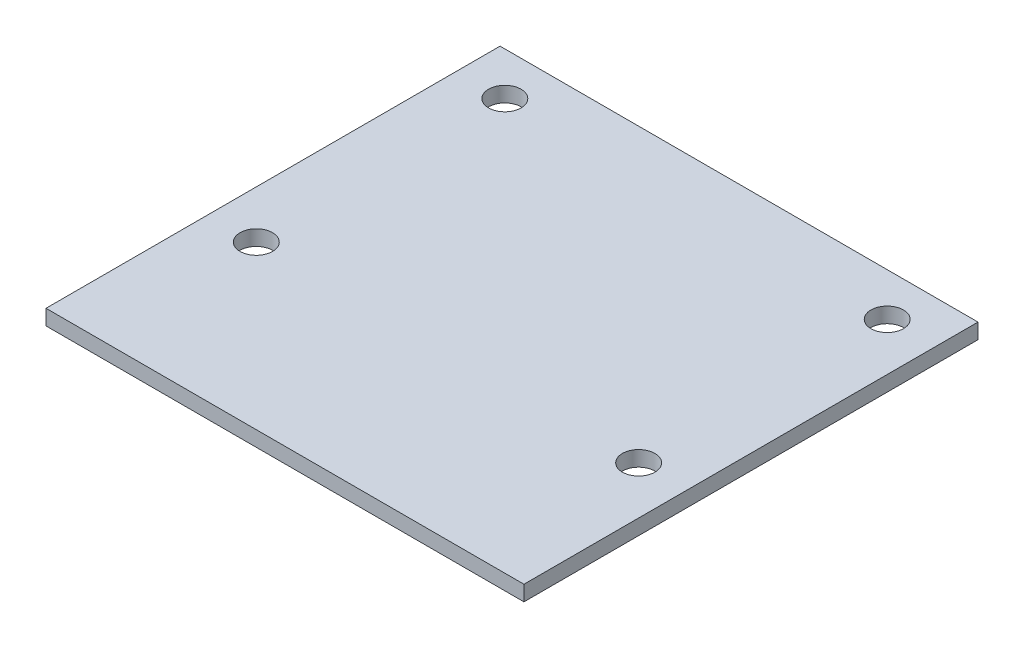
ISO-10303-21;
HEADER;
FILE_DESCRIPTION(('STEP AP214'),'2;1');
FILE_NAME('part.step','',(''),(''),'','','');
FILE_SCHEMA(('AUTOMOTIVE_DESIGN { 1 0 10303 214 1 1 1 1 }'));
ENDSEC;
DATA;
#1=APPLICATION_CONTEXT('core data for automotive mechanical design processes');
#2=APPLICATION_PROTOCOL_DEFINITION('international standard','automotive_design',2000,#1);
#3=PRODUCT_CONTEXT('',#1,'mechanical');
#4=PRODUCT('Part','Part','',(#3));
#5=PRODUCT_RELATED_PRODUCT_CATEGORY('part','',(#4));
#6=PRODUCT_DEFINITION_FORMATION('','',#4);
#7=PRODUCT_DEFINITION_CONTEXT('part definition',#1,'design');
#8=PRODUCT_DEFINITION('design','',#6,#7);
#9=PRODUCT_DEFINITION_SHAPE('','',#8);
#10=(LENGTH_UNIT() NAMED_UNIT(*) SI_UNIT(.MILLI.,.METRE.));
#11=(NAMED_UNIT(*) PLANE_ANGLE_UNIT() SI_UNIT($,.RADIAN.));
#12=(NAMED_UNIT(*) SI_UNIT($,.STERADIAN.) SOLID_ANGLE_UNIT());
#13=UNCERTAINTY_MEASURE_WITH_UNIT(LENGTH_MEASURE(1.E-05),#10,'distance_accuracy_value','');
#14=(GEOMETRIC_REPRESENTATION_CONTEXT(3) GLOBAL_UNCERTAINTY_ASSIGNED_CONTEXT((#13)) GLOBAL_UNIT_ASSIGNED_CONTEXT((#10,
#11,#12)) REPRESENTATION_CONTEXT('',''));
#15=CARTESIAN_POINT('',(0.,0.,0.));
#16=DIRECTION('',(0.,0.,1.));
#17=DIRECTION('',(1.,0.,0.));
#18=AXIS2_PLACEMENT_3D('',#15,#16,#17);
#19=CARTESIAN_POINT('',(0.,1.6,0.));
#20=DIRECTION('',(0.,-1.,0.));
#21=DIRECTION('',(0.,0.,-1.));
#22=AXIS2_PLACEMENT_3D('',#19,#20,#21);
#23=PLANE('',#22);
#24=DIRECTION('',(0.,0.,1.));
#25=VECTOR('',#24,1.);
#26=CARTESIAN_POINT('',(0.,1.6,0.));
#27=LINE('',#26,#25);
#28=CARTESIAN_POINT('',(0.,1.6,-47.5));
#29=VERTEX_POINT('',#28);
#30=CARTESIAN_POINT('',(0.,1.6,0.));
#31=VERTEX_POINT('',#30);
#32=EDGE_CURVE('E98',#29,#31,#27,.T.);
#33=ORIENTED_EDGE('',*,*,#32,.T.);
#34=DIRECTION('',(1.,0.,0.));
#35=VECTOR('',#34,1.);
#36=CARTESIAN_POINT('',(0.,1.6,0.));
#37=LINE('',#36,#35);
#38=CARTESIAN_POINT('',(50.,1.6,0.));
#39=VERTEX_POINT('',#38);
#40=EDGE_CURVE('E93',#31,#39,#37,.T.);
#41=ORIENTED_EDGE('',*,*,#40,.T.);
#42=DIRECTION('',(0.,0.,-1.));
#43=VECTOR('',#42,1.);
#44=CARTESIAN_POINT('',(50.,1.6,0.));
#45=LINE('',#44,#43);
#46=CARTESIAN_POINT('',(50.,1.6,-47.5));
#47=VERTEX_POINT('',#46);
#48=EDGE_CURVE('E96',#39,#47,#45,.T.);
#49=ORIENTED_EDGE('',*,*,#48,.T.);
#50=DIRECTION('',(-1.,0.,0.));
#51=VECTOR('',#50,1.);
#52=CARTESIAN_POINT('',(0.,1.6,-47.5));
#53=LINE('',#52,#51);
#54=EDGE_CURVE('E63',#47,#29,#53,.T.);
#55=ORIENTED_EDGE('',*,*,#54,.T.);
#56=EDGE_LOOP('',(#33,#41,#49,#55));
#57=FACE_BOUND('',#56,.T.);
#58=CARTESIAN_POINT('',(5.,1.6,-17.));
#59=DIRECTION('',(0.,1.,0.));
#60=DIRECTION('',(0.,0.,1.));
#61=AXIS2_PLACEMENT_3D('',#58,#59,#60);
#62=CIRCLE('',#61,1.7);
#63=CARTESIAN_POINT('',(5.,1.6,-15.3));
#64=VERTEX_POINT('',#63);
#65=EDGE_CURVE('E118',#64,#64,#62,.T.);
#66=ORIENTED_EDGE('',*,*,#65,.F.);
#67=EDGE_LOOP('',(#66));
#68=FACE_BOUND('',#67,.T.);
#69=CARTESIAN_POINT('',(5.,1.6,-43.));
#70=DIRECTION('',(0.,1.,0.));
#71=DIRECTION('',(0.,0.,1.));
#72=AXIS2_PLACEMENT_3D('',#69,#70,#71);
#73=CIRCLE('',#72,1.7);
#74=CARTESIAN_POINT('',(5.,1.6,-41.3));
#75=VERTEX_POINT('',#74);
#76=EDGE_CURVE('E140',#75,#75,#73,.T.);
#77=ORIENTED_EDGE('',*,*,#76,.F.);
#78=EDGE_LOOP('',(#77));
#79=FACE_BOUND('',#78,.T.);
#80=CARTESIAN_POINT('',(45.,1.6,-17.));
#81=DIRECTION('',(0.,1.,0.));
#82=DIRECTION('',(0.,0.,1.));
#83=AXIS2_PLACEMENT_3D('',#80,#81,#82);
#84=CIRCLE('',#83,1.7);
#85=CARTESIAN_POINT('',(45.,1.6,-15.3));
#86=VERTEX_POINT('',#85);
#87=EDGE_CURVE('E148',#86,#86,#84,.T.);
#88=ORIENTED_EDGE('',*,*,#87,.F.);
#89=EDGE_LOOP('',(#88));
#90=FACE_BOUND('',#89,.T.);
#91=CARTESIAN_POINT('',(45.,1.6,-43.));
#92=DIRECTION('',(0.,1.,0.));
#93=DIRECTION('',(0.,0.,1.));
#94=AXIS2_PLACEMENT_3D('',#91,#92,#93);
#95=CIRCLE('',#94,1.7);
#96=CARTESIAN_POINT('',(45.,1.6,-41.3));
#97=VERTEX_POINT('',#96);
#98=EDGE_CURVE('E156',#97,#97,#95,.T.);
#99=ORIENTED_EDGE('',*,*,#98,.F.);
#100=EDGE_LOOP('',(#99));
#101=FACE_BOUND('',#100,.T.);
#102=ADVANCED_FACE('F45',(#57,#68,#79,#90,#101),#23,.F.);
#103=CARTESIAN_POINT('',(0.,0.,0.));
#104=DIRECTION('',(0.,-1.,0.));
#105=DIRECTION('',(0.,0.,-1.));
#106=AXIS2_PLACEMENT_3D('',#103,#104,#105);
#107=PLANE('',#106);
#108=CARTESIAN_POINT('',(45.,0.,-17.));
#109=DIRECTION('',(0.,1.,0.));
#110=DIRECTION('',(0.,0.,1.));
#111=AXIS2_PLACEMENT_3D('',#108,#109,#110);
#112=CIRCLE('',#111,1.7);
#113=CARTESIAN_POINT('',(45.,0.,-15.3));
#114=VERTEX_POINT('',#113);
#115=EDGE_CURVE('E152',#114,#114,#112,.T.);
#116=ORIENTED_EDGE('',*,*,#115,.T.);
#117=EDGE_LOOP('',(#116));
#118=FACE_BOUND('',#117,.T.);
#119=CARTESIAN_POINT('',(5.,0.,-17.));
#120=DIRECTION('',(0.,1.,0.));
#121=DIRECTION('',(0.,0.,1.));
#122=AXIS2_PLACEMENT_3D('',#119,#120,#121);
#123=CIRCLE('',#122,1.7);
#124=CARTESIAN_POINT('',(5.,0.,-15.3));
#125=VERTEX_POINT('',#124);
#126=EDGE_CURVE('E136',#125,#125,#123,.T.);
#127=ORIENTED_EDGE('',*,*,#126,.T.);
#128=EDGE_LOOP('',(#127));
#129=FACE_BOUND('',#128,.T.);
#130=DIRECTION('',(0.,0.,1.));
#131=VECTOR('',#130,1.);
#132=CARTESIAN_POINT('',(0.,0.,0.));
#133=LINE('',#132,#131);
#134=CARTESIAN_POINT('',(0.,0.,-47.5));
#135=VERTEX_POINT('',#134);
#136=CARTESIAN_POINT('',(0.,0.,0.));
#137=VERTEX_POINT('',#136);
#138=EDGE_CURVE('E114',#135,#137,#133,.T.);
#139=ORIENTED_EDGE('',*,*,#138,.F.);
#140=DIRECTION('',(-1.,0.,0.));
#141=VECTOR('',#140,1.);
#142=CARTESIAN_POINT('',(0.,0.,-47.5));
#143=LINE('',#142,#141);
#144=CARTESIAN_POINT('',(50.,0.,-47.5));
#145=VERTEX_POINT('',#144);
#146=EDGE_CURVE('E86',#145,#135,#143,.T.);
#147=ORIENTED_EDGE('',*,*,#146,.F.);
#148=DIRECTION('',(0.,0.,-1.));
#149=VECTOR('',#148,1.);
#150=CARTESIAN_POINT('',(50.,0.,0.));
#151=LINE('',#150,#149);
#152=CARTESIAN_POINT('',(50.,0.,0.));
#153=VERTEX_POINT('',#152);
#154=EDGE_CURVE('E80',#153,#145,#151,.T.);
#155=ORIENTED_EDGE('',*,*,#154,.F.);
#156=DIRECTION('',(1.,0.,0.));
#157=VECTOR('',#156,1.);
#158=CARTESIAN_POINT('',(0.,0.,0.));
#159=LINE('',#158,#157);
#160=EDGE_CURVE('E103',#137,#153,#159,.T.);
#161=ORIENTED_EDGE('',*,*,#160,.F.);
#162=EDGE_LOOP('',(#139,#147,#155,#161));
#163=FACE_BOUND('',#162,.T.);
#164=CARTESIAN_POINT('',(5.,0.,-43.));
#165=DIRECTION('',(0.,1.,0.));
#166=DIRECTION('',(0.,0.,1.));
#167=AXIS2_PLACEMENT_3D('',#164,#165,#166);
#168=CIRCLE('',#167,1.7);
#169=CARTESIAN_POINT('',(5.,0.,-41.3));
#170=VERTEX_POINT('',#169);
#171=EDGE_CURVE('E144',#170,#170,#168,.T.);
#172=ORIENTED_EDGE('',*,*,#171,.T.);
#173=EDGE_LOOP('',(#172));
#174=FACE_BOUND('',#173,.T.);
#175=CARTESIAN_POINT('',(45.,0.,-43.));
#176=DIRECTION('',(0.,1.,0.));
#177=DIRECTION('',(0.,0.,1.));
#178=AXIS2_PLACEMENT_3D('',#175,#176,#177);
#179=CIRCLE('',#178,1.7);
#180=CARTESIAN_POINT('',(45.,0.,-41.3));
#181=VERTEX_POINT('',#180);
#182=EDGE_CURVE('E160',#181,#181,#179,.T.);
#183=ORIENTED_EDGE('',*,*,#182,.T.);
#184=EDGE_LOOP('',(#183));
#185=FACE_BOUND('',#184,.T.);
#186=ADVANCED_FACE('F131',(#118,#129,#163,#174,#185),#107,.T.);
#187=CARTESIAN_POINT('',(0.,1.6,0.));
#188=DIRECTION('',(1.,0.,0.));
#189=DIRECTION('',(0.,0.,-1.));
#190=AXIS2_PLACEMENT_3D('',#187,#188,#189);
#191=PLANE('',#190);
#192=ORIENTED_EDGE('',*,*,#138,.T.);
#193=DIRECTION('',(0.,-1.,0.));
#194=VECTOR('',#193,1.);
#195=CARTESIAN_POINT('',(0.,1.6,0.));
#196=LINE('',#195,#194);
#197=EDGE_CURVE('E11',#31,#137,#196,.T.);
#198=ORIENTED_EDGE('',*,*,#197,.F.);
#199=ORIENTED_EDGE('',*,*,#32,.F.);
#200=DIRECTION('',(0.,-1.,0.));
#201=VECTOR('',#200,1.);
#202=CARTESIAN_POINT('',(0.,1.6,-47.5));
#203=LINE('',#202,#201);
#204=EDGE_CURVE('E110',#29,#135,#203,.T.);
#205=ORIENTED_EDGE('',*,*,#204,.T.);
#206=EDGE_LOOP('',(#192,#198,#199,#205));
#207=FACE_BOUND('',#206,.T.);
#208=ADVANCED_FACE('F47',(#207),#191,.F.);
#209=CARTESIAN_POINT('',(0.,1.6,0.));
#210=DIRECTION('',(0.,0.,-1.));
#211=DIRECTION('',(-1.,0.,0.));
#212=AXIS2_PLACEMENT_3D('',#209,#210,#211);
#213=PLANE('',#212);
#214=ORIENTED_EDGE('',*,*,#160,.T.);
#215=DIRECTION('',(0.,-1.,0.));
#216=VECTOR('',#215,1.);
#217=CARTESIAN_POINT('',(50.,1.6,0.));
#218=LINE('',#217,#216);
#219=EDGE_CURVE('E55',#39,#153,#218,.T.);
#220=ORIENTED_EDGE('',*,*,#219,.F.);
#221=ORIENTED_EDGE('',*,*,#40,.F.);
#222=ORIENTED_EDGE('',*,*,#197,.T.);
#223=EDGE_LOOP('',(#214,#220,#221,#222));
#224=FACE_BOUND('',#223,.T.);
#225=ADVANCED_FACE('F102',(#224),#213,.F.);
#226=CARTESIAN_POINT('',(50.,1.6,0.));
#227=DIRECTION('',(-1.,0.,0.));
#228=DIRECTION('',(0.,0.,1.));
#229=AXIS2_PLACEMENT_3D('',#226,#227,#228);
#230=PLANE('',#229);
#231=ORIENTED_EDGE('',*,*,#154,.T.);
#232=DIRECTION('',(0.,-1.,0.));
#233=VECTOR('',#232,1.);
#234=CARTESIAN_POINT('',(50.,1.6,-47.5));
#235=LINE('',#234,#233);
#236=EDGE_CURVE('E105',#47,#145,#235,.T.);
#237=ORIENTED_EDGE('',*,*,#236,.F.);
#238=ORIENTED_EDGE('',*,*,#48,.F.);
#239=ORIENTED_EDGE('',*,*,#219,.T.);
#240=EDGE_LOOP('',(#231,#237,#238,#239));
#241=FACE_BOUND('',#240,.T.);
#242=ADVANCED_FACE('F106',(#241),#230,.F.);
#243=CARTESIAN_POINT('',(0.,1.6,-47.5));
#244=DIRECTION('',(0.,0.,1.));
#245=DIRECTION('',(1.,0.,0.));
#246=AXIS2_PLACEMENT_3D('',#243,#244,#245);
#247=PLANE('',#246);
#248=ORIENTED_EDGE('',*,*,#146,.T.);
#249=ORIENTED_EDGE('',*,*,#204,.F.);
#250=ORIENTED_EDGE('',*,*,#54,.F.);
#251=ORIENTED_EDGE('',*,*,#236,.T.);
#252=EDGE_LOOP('',(#248,#249,#250,#251));
#253=FACE_BOUND('',#252,.T.);
#254=ADVANCED_FACE('F128',(#253),#247,.F.);
#255=CARTESIAN_POINT('',(5.,1.6,-17.));
#256=DIRECTION('',(0.,-1.,0.));
#257=DIRECTION('',(0.,0.,-1.));
#258=AXIS2_PLACEMENT_3D('',#255,#256,#257);
#259=CYLINDRICAL_SURFACE('',#258,1.7);
#260=ORIENTED_EDGE('',*,*,#65,.T.);
#261=EDGE_LOOP('',(#260));
#262=FACE_BOUND('',#261,.T.);
#263=ORIENTED_EDGE('',*,*,#126,.F.);
#264=EDGE_LOOP('',(#263));
#265=FACE_BOUND('',#264,.T.);
#266=ADVANCED_FACE('F179',(#262,#265),#259,.F.);
#267=CARTESIAN_POINT('',(5.,1.6,-43.));
#268=DIRECTION('',(0.,-1.,0.));
#269=DIRECTION('',(0.,0.,-1.));
#270=AXIS2_PLACEMENT_3D('',#267,#268,#269);
#271=CYLINDRICAL_SURFACE('',#270,1.7);
#272=ORIENTED_EDGE('',*,*,#76,.T.);
#273=EDGE_LOOP('',(#272));
#274=FACE_BOUND('',#273,.T.);
#275=ORIENTED_EDGE('',*,*,#171,.F.);
#276=EDGE_LOOP('',(#275));
#277=FACE_BOUND('',#276,.T.);
#278=ADVANCED_FACE('F224',(#274,#277),#271,.F.);
#279=CARTESIAN_POINT('',(45.,1.6,-17.));
#280=DIRECTION('',(0.,-1.,0.));
#281=DIRECTION('',(0.,0.,-1.));
#282=AXIS2_PLACEMENT_3D('',#279,#280,#281);
#283=CYLINDRICAL_SURFACE('',#282,1.7);
#284=ORIENTED_EDGE('',*,*,#87,.T.);
#285=EDGE_LOOP('',(#284));
#286=FACE_BOUND('',#285,.T.);
#287=ORIENTED_EDGE('',*,*,#115,.F.);
#288=EDGE_LOOP('',(#287));
#289=FACE_BOUND('',#288,.T.);
#290=ADVANCED_FACE('F232',(#286,#289),#283,.F.);
#291=CARTESIAN_POINT('',(45.,1.6,-43.));
#292=DIRECTION('',(0.,-1.,0.));
#293=DIRECTION('',(0.,0.,-1.));
#294=AXIS2_PLACEMENT_3D('',#291,#292,#293);
#295=CYLINDRICAL_SURFACE('',#294,1.7);
#296=ORIENTED_EDGE('',*,*,#98,.T.);
#297=EDGE_LOOP('',(#296));
#298=FACE_BOUND('',#297,.T.);
#299=ORIENTED_EDGE('',*,*,#182,.F.);
#300=EDGE_LOOP('',(#299));
#301=FACE_BOUND('',#300,.T.);
#302=ADVANCED_FACE('F168',(#298,#301),#295,.F.);
#303=CLOSED_SHELL('',(#102,#186,#208,#225,#242,#254,#266,#278,#290,#302));
#304=MANIFOLD_SOLID_BREP('B2',#303);
#305=ADVANCED_BREP_SHAPE_REPRESENTATION('',(#18,#304),#14);
#306=SHAPE_DEFINITION_REPRESENTATION(#9,#305);
ENDSEC;
END-ISO-10303-21;
